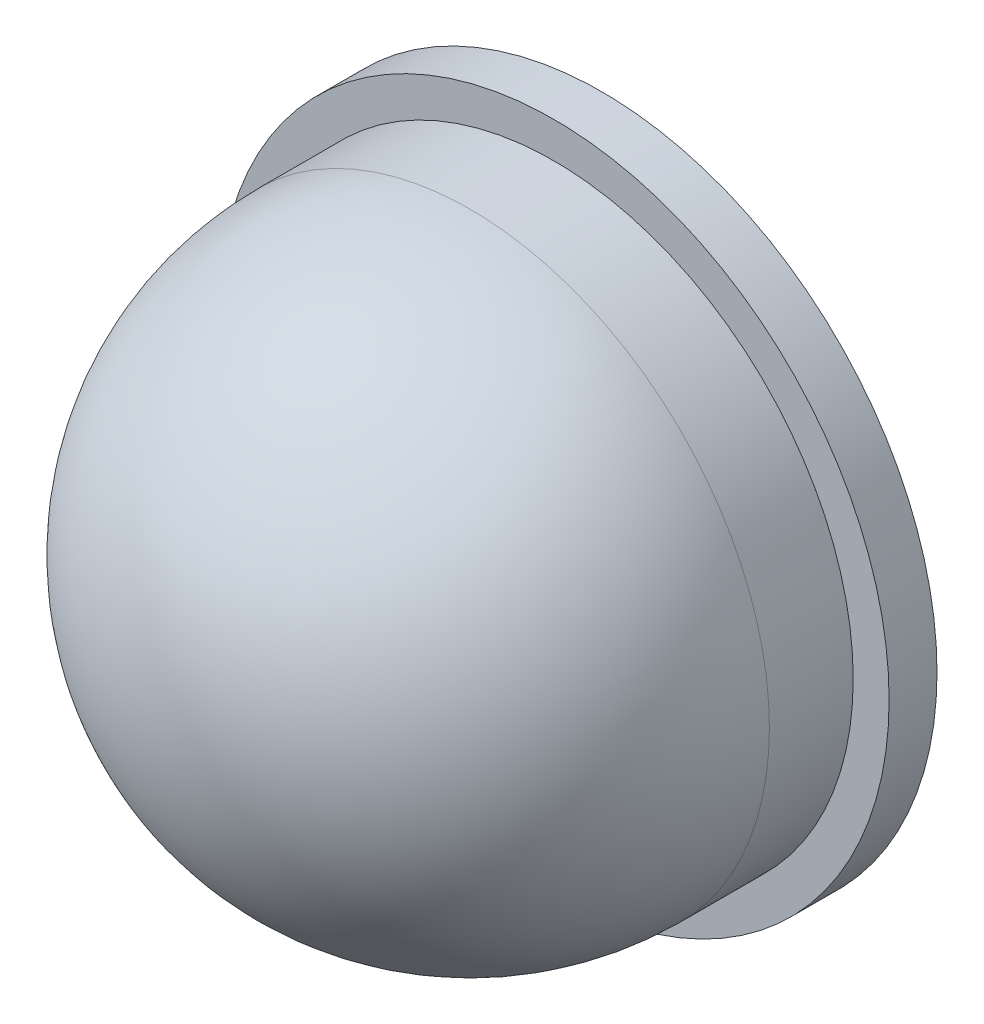
ISO-10303-21;
HEADER;
FILE_DESCRIPTION(('STEP AP214'),'2;1');
FILE_NAME('part.step','',(''),(''),'','','');
FILE_SCHEMA(('AUTOMOTIVE_DESIGN { 1 0 10303 214 1 1 1 1 }'));
ENDSEC;
DATA;
#1=APPLICATION_CONTEXT('core data for automotive mechanical design processes');
#2=APPLICATION_PROTOCOL_DEFINITION('international standard','automotive_design',2000,#1);
#3=PRODUCT_CONTEXT('',#1,'mechanical');
#4=PRODUCT('Part','Part','',(#3));
#5=PRODUCT_RELATED_PRODUCT_CATEGORY('part','',(#4));
#6=PRODUCT_DEFINITION_FORMATION('','',#4);
#7=PRODUCT_DEFINITION_CONTEXT('part definition',#1,'design');
#8=PRODUCT_DEFINITION('design','',#6,#7);
#9=PRODUCT_DEFINITION_SHAPE('','',#8);
#10=(LENGTH_UNIT() NAMED_UNIT(*) SI_UNIT(.MILLI.,.METRE.));
#11=(NAMED_UNIT(*) PLANE_ANGLE_UNIT() SI_UNIT($,.RADIAN.));
#12=(NAMED_UNIT(*) SI_UNIT($,.STERADIAN.) SOLID_ANGLE_UNIT());
#13=UNCERTAINTY_MEASURE_WITH_UNIT(LENGTH_MEASURE(1.E-05),#10,'distance_accuracy_value','');
#14=(GEOMETRIC_REPRESENTATION_CONTEXT(3) GLOBAL_UNCERTAINTY_ASSIGNED_CONTEXT((#13)) GLOBAL_UNIT_ASSIGNED_CONTEXT((#10,
#11,#12)) REPRESENTATION_CONTEXT('',''));
#15=CARTESIAN_POINT('',(0.,0.,0.));
#16=DIRECTION('',(0.,0.,1.));
#17=DIRECTION('',(1.,0.,0.));
#18=AXIS2_PLACEMENT_3D('',#15,#16,#17);
#19=CARTESIAN_POINT('',(0.,0.,16.));
#20=DIRECTION('',(0.,0.,-1.));
#21=DIRECTION('',(-1.,0.,0.));
#22=AXIS2_PLACEMENT_3D('',#19,#20,#21);
#23=CYLINDRICAL_SURFACE('',#22,12.5);
#24=CARTESIAN_POINT('',(0.,0.,3.5));
#25=DIRECTION('',(0.,0.,-1.));
#26=DIRECTION('',(-1.,0.,0.));
#27=AXIS2_PLACEMENT_3D('',#24,#25,#26);
#28=CIRCLE('',#27,12.5);
#29=CARTESIAN_POINT('',(-12.5,0.,3.5));
#30=VERTEX_POINT('',#29);
#31=EDGE_CURVE('E10',#30,#30,#28,.T.);
#32=ORIENTED_EDGE('',*,*,#31,.T.);
#33=EDGE_LOOP('',(#32));
#34=FACE_BOUND('',#33,.T.);
#35=CARTESIAN_POINT('',(0.,0.,0.));
#36=DIRECTION('',(0.,0.,1.));
#37=DIRECTION('',(1.,0.,0.));
#38=AXIS2_PLACEMENT_3D('',#35,#36,#37);
#39=CIRCLE('',#38,12.5);
#40=CARTESIAN_POINT('',(12.5,0.,0.));
#41=VERTEX_POINT('',#40);
#42=EDGE_CURVE('E45',#41,#41,#39,.T.);
#43=ORIENTED_EDGE('',*,*,#42,.T.);
#44=EDGE_LOOP('',(#43));
#45=FACE_BOUND('',#44,.T.);
#46=ADVANCED_FACE('F37',(#34,#45),#23,.T.);
#47=CARTESIAN_POINT('',(0.,0.,3.5));
#48=DIRECTION('',(0.,0.,1.));
#49=DIRECTION('',(1.,0.,0.));
#50=AXIS2_PLACEMENT_3D('',#47,#48,#49);
#51=SPHERICAL_SURFACE('',#50,12.5);
#52=ORIENTED_EDGE('',*,*,#31,.F.);
#53=EDGE_LOOP('',(#52));
#54=FACE_BOUND('',#53,.T.);
#55=ADVANCED_FACE('F39',(#54),#51,.T.);
#56=CARTESIAN_POINT('',(0.,0.,-2.));
#57=DIRECTION('',(0.,0.,1.));
#58=DIRECTION('',(1.,0.,0.));
#59=AXIS2_PLACEMENT_3D('',#56,#57,#58);
#60=CYLINDRICAL_SURFACE('',#59,14.);
#61=CARTESIAN_POINT('',(0.,0.,-2.));
#62=DIRECTION('',(0.,0.,-1.));
#63=DIRECTION('',(-1.,0.,0.));
#64=AXIS2_PLACEMENT_3D('',#61,#62,#63);
#65=CIRCLE('',#64,14.);
#66=CARTESIAN_POINT('',(-14.,0.,-2.));
#67=VERTEX_POINT('',#66);
#68=EDGE_CURVE('E50',#67,#67,#65,.T.);
#69=ORIENTED_EDGE('',*,*,#68,.F.);
#70=EDGE_LOOP('',(#69));
#71=FACE_BOUND('',#70,.T.);
#72=CARTESIAN_POINT('',(0.,0.,0.));
#73=DIRECTION('',(0.,0.,-1.));
#74=DIRECTION('',(-1.,0.,0.));
#75=AXIS2_PLACEMENT_3D('',#72,#73,#74);
#76=CIRCLE('',#75,14.);
#77=CARTESIAN_POINT('',(-14.,0.,0.));
#78=VERTEX_POINT('',#77);
#79=EDGE_CURVE('E55',#78,#78,#76,.T.);
#80=ORIENTED_EDGE('',*,*,#79,.T.);
#81=EDGE_LOOP('',(#80));
#82=FACE_BOUND('',#81,.T.);
#83=ADVANCED_FACE('F62',(#71,#82),#60,.T.);
#84=CARTESIAN_POINT('',(0.,0.,-2.));
#85=DIRECTION('',(0.,0.,-1.));
#86=DIRECTION('',(-1.,0.,0.));
#87=AXIS2_PLACEMENT_3D('',#84,#85,#86);
#88=PLANE('',#87);
#89=ORIENTED_EDGE('',*,*,#68,.T.);
#90=EDGE_LOOP('',(#89));
#91=FACE_BOUND('',#90,.T.);
#92=ADVANCED_FACE('F66',(#91),#88,.T.);
#93=CARTESIAN_POINT('',(0.,0.,0.));
#94=DIRECTION('',(0.,0.,-1.));
#95=DIRECTION('',(-1.,0.,0.));
#96=AXIS2_PLACEMENT_3D('',#93,#94,#95);
#97=PLANE('',#96);
#98=ORIENTED_EDGE('',*,*,#42,.F.);
#99=EDGE_LOOP('',(#98));
#100=FACE_BOUND('',#99,.T.);
#101=ORIENTED_EDGE('',*,*,#79,.F.);
#102=EDGE_LOOP('',(#101));
#103=FACE_BOUND('',#102,.T.);
#104=ADVANCED_FACE('F64',(#100,#103),#97,.F.);
#105=CLOSED_SHELL('',(#46,#55,#83,#92,#104));
#106=MANIFOLD_SOLID_BREP('B2',#105);
#107=ADVANCED_BREP_SHAPE_REPRESENTATION('',(#18,#106),#14);
#108=SHAPE_DEFINITION_REPRESENTATION(#9,#107);
ENDSEC;
END-ISO-10303-21;
